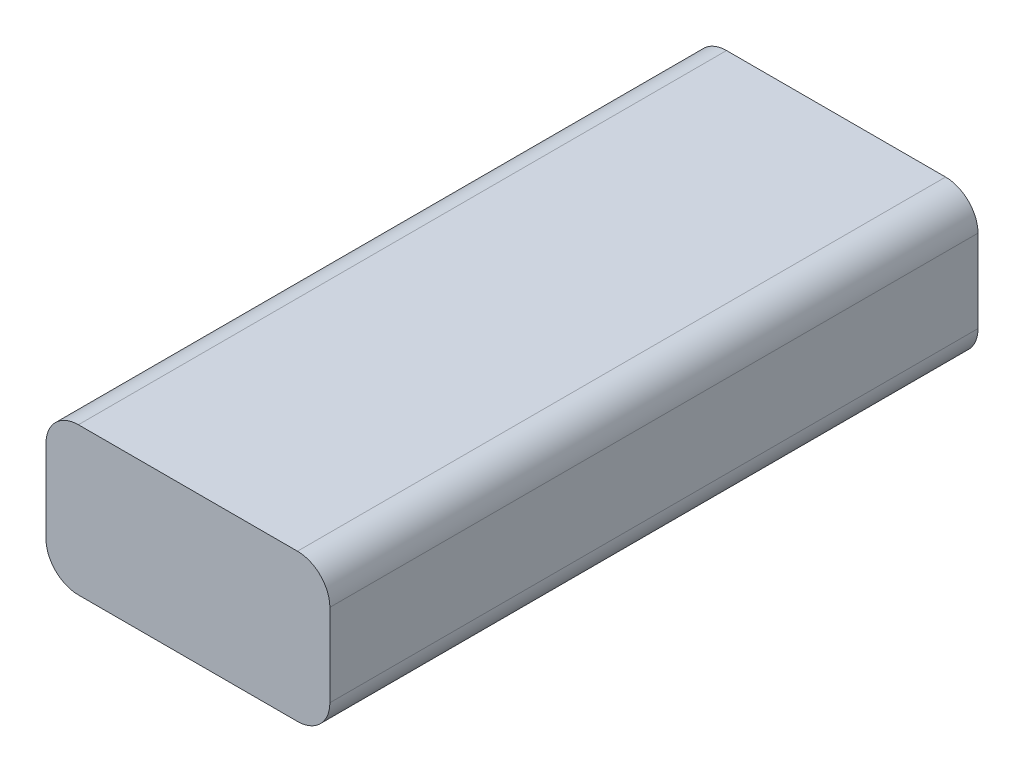
ISO-10303-21;
HEADER;
FILE_DESCRIPTION(('STEP AP214'),'2;1');
FILE_NAME('part.step','',(''),(''),'','','');
FILE_SCHEMA(('AUTOMOTIVE_DESIGN { 1 0 10303 214 1 1 1 1 }'));
ENDSEC;
DATA;
#1=APPLICATION_CONTEXT('core data for automotive mechanical design processes');
#2=APPLICATION_PROTOCOL_DEFINITION('international standard','automotive_design',2000,#1);
#3=PRODUCT_CONTEXT('',#1,'mechanical');
#4=PRODUCT('Part','Part','',(#3));
#5=PRODUCT_RELATED_PRODUCT_CATEGORY('part','',(#4));
#6=PRODUCT_DEFINITION_FORMATION('','',#4);
#7=PRODUCT_DEFINITION_CONTEXT('part definition',#1,'design');
#8=PRODUCT_DEFINITION('design','',#6,#7);
#9=PRODUCT_DEFINITION_SHAPE('','',#8);
#10=(LENGTH_UNIT() NAMED_UNIT(*) SI_UNIT(.MILLI.,.METRE.));
#11=(NAMED_UNIT(*) PLANE_ANGLE_UNIT() SI_UNIT($,.RADIAN.));
#12=(NAMED_UNIT(*) SI_UNIT($,.STERADIAN.) SOLID_ANGLE_UNIT());
#13=UNCERTAINTY_MEASURE_WITH_UNIT(LENGTH_MEASURE(1.E-05),#10,'distance_accuracy_value','');
#14=(GEOMETRIC_REPRESENTATION_CONTEXT(3) GLOBAL_UNCERTAINTY_ASSIGNED_CONTEXT((#13)) GLOBAL_UNIT_ASSIGNED_CONTEXT((#10,
#11,#12)) REPRESENTATION_CONTEXT('',''));
#15=CARTESIAN_POINT('',(0.,0.,0.));
#16=DIRECTION('',(0.,0.,1.));
#17=DIRECTION('',(1.,0.,0.));
#18=AXIS2_PLACEMENT_3D('',#15,#16,#17);
#19=CARTESIAN_POINT('',(-3.26703046092185,-0.305894388777558,25.4));
#20=DIRECTION('',(0.,0.,-1.));
#21=DIRECTION('',(-1.,0.,0.));
#22=AXIS2_PLACEMENT_3D('',#19,#20,#21);
#23=CYLINDRICAL_SURFACE('',#22,1.27);
#24=CARTESIAN_POINT('',(-3.26703046092185,-0.305894388777558,0.));
#25=DIRECTION('',(0.,0.,1.));
#26=DIRECTION('',(1.,0.,0.));
#27=AXIS2_PLACEMENT_3D('',#24,#25,#26);
#28=CIRCLE('',#27,1.27);
#29=CARTESIAN_POINT('',(-4.53703046092185,-0.305894388777549,0.));
#30=VERTEX_POINT('',#29);
#31=CARTESIAN_POINT('',(-3.26703046092184,-1.57589438877756,0.));
#32=VERTEX_POINT('',#31);
#33=EDGE_CURVE('E128',#30,#32,#28,.T.);
#34=ORIENTED_EDGE('',*,*,#33,.T.);
#35=DIRECTION('',(0.,0.,-1.));
#36=VECTOR('',#35,1.);
#37=CARTESIAN_POINT('',(-3.26703046092184,-1.57589438877756,25.4));
#38=LINE('',#37,#36);
#39=CARTESIAN_POINT('',(-3.26703046092184,-1.57589438877756,25.4));
#40=VERTEX_POINT('',#39);
#41=EDGE_CURVE('E11',#40,#32,#38,.T.);
#42=ORIENTED_EDGE('',*,*,#41,.F.);
#43=CARTESIAN_POINT('',(-3.26703046092185,-0.305894388777558,25.4));
#44=DIRECTION('',(0.,0.,1.));
#45=DIRECTION('',(1.,0.,0.));
#46=AXIS2_PLACEMENT_3D('',#43,#44,#45);
#47=CIRCLE('',#46,1.27);
#48=CARTESIAN_POINT('',(-4.53703046092185,-0.305894388777549,25.4));
#49=VERTEX_POINT('',#48);
#50=EDGE_CURVE('E142',#49,#40,#47,.T.);
#51=ORIENTED_EDGE('',*,*,#50,.F.);
#52=DIRECTION('',(0.,0.,-1.));
#53=VECTOR('',#52,1.);
#54=CARTESIAN_POINT('',(-4.53703046092185,-0.305894388777549,25.4));
#55=LINE('',#54,#53);
#56=EDGE_CURVE('E124',#49,#30,#55,.T.);
#57=ORIENTED_EDGE('',*,*,#56,.T.);
#58=EDGE_LOOP('',(#34,#42,#51,#57));
#59=FACE_BOUND('',#58,.T.);
#60=ADVANCED_FACE('F32',(#59),#23,.T.);
#61=CARTESIAN_POINT('',(5.31816953907815,-1.57589438877756,25.4));
#62=DIRECTION('',(0.,1.,0.));
#63=DIRECTION('',(-1.,0.,0.));
#64=AXIS2_PLACEMENT_3D('',#61,#62,#63);
#65=PLANE('',#64);
#66=DIRECTION('',(1.,0.,0.));
#67=VECTOR('',#66,1.);
#68=CARTESIAN_POINT('',(5.31816953907815,-1.57589438877756,0.));
#69=LINE('',#68,#67);
#70=CARTESIAN_POINT('',(5.31816953907814,-1.57589438877756,0.));
#71=VERTEX_POINT('',#70);
#72=EDGE_CURVE('E131',#32,#71,#69,.T.);
#73=ORIENTED_EDGE('',*,*,#72,.T.);
#74=DIRECTION('',(0.,0.,-1.));
#75=VECTOR('',#74,1.);
#76=CARTESIAN_POINT('',(5.31816953907814,-1.57589438877756,25.4));
#77=LINE('',#76,#75);
#78=CARTESIAN_POINT('',(5.31816953907814,-1.57589438877756,25.4));
#79=VERTEX_POINT('',#78);
#80=EDGE_CURVE('E40',#79,#71,#77,.T.);
#81=ORIENTED_EDGE('',*,*,#80,.F.);
#82=DIRECTION('',(1.,0.,0.));
#83=VECTOR('',#82,1.);
#84=CARTESIAN_POINT('',(5.31816953907815,-1.57589438877756,25.4));
#85=LINE('',#84,#83);
#86=EDGE_CURVE('E91',#40,#79,#85,.T.);
#87=ORIENTED_EDGE('',*,*,#86,.F.);
#88=ORIENTED_EDGE('',*,*,#41,.T.);
#89=EDGE_LOOP('',(#73,#81,#87,#88));
#90=FACE_BOUND('',#89,.T.);
#91=ADVANCED_FACE('F177',(#90),#65,.F.);
#92=CARTESIAN_POINT('',(5.31816953907815,-0.305894388777557,25.4));
#93=DIRECTION('',(0.,0.,-1.));
#94=DIRECTION('',(-1.,0.,0.));
#95=AXIS2_PLACEMENT_3D('',#92,#93,#94);
#96=CYLINDRICAL_SURFACE('',#95,1.27);
#97=CARTESIAN_POINT('',(5.31816953907815,-0.305894388777557,0.));
#98=DIRECTION('',(0.,0.,1.));
#99=DIRECTION('',(1.,0.,0.));
#100=AXIS2_PLACEMENT_3D('',#97,#98,#99);
#101=CIRCLE('',#100,1.27);
#102=CARTESIAN_POINT('',(6.58816953907816,-0.305894388777547,0.));
#103=VERTEX_POINT('',#102);
#104=EDGE_CURVE('E133',#71,#103,#101,.T.);
#105=ORIENTED_EDGE('',*,*,#104,.T.);
#106=DIRECTION('',(0.,0.,-1.));
#107=VECTOR('',#106,1.);
#108=CARTESIAN_POINT('',(6.58816953907816,-0.305894388777547,25.4));
#109=LINE('',#108,#107);
#110=CARTESIAN_POINT('',(6.58816953907816,-0.305894388777547,25.4));
#111=VERTEX_POINT('',#110);
#112=EDGE_CURVE('E149',#111,#103,#109,.T.);
#113=ORIENTED_EDGE('',*,*,#112,.F.);
#114=CARTESIAN_POINT('',(5.31816953907815,-0.305894388777557,25.4));
#115=DIRECTION('',(0.,0.,1.));
#116=DIRECTION('',(1.,0.,0.));
#117=AXIS2_PLACEMENT_3D('',#114,#115,#116);
#118=CIRCLE('',#117,1.27);
#119=EDGE_CURVE('E157',#79,#111,#118,.T.);
#120=ORIENTED_EDGE('',*,*,#119,.F.);
#121=ORIENTED_EDGE('',*,*,#80,.T.);
#122=EDGE_LOOP('',(#105,#113,#120,#121));
#123=FACE_BOUND('',#122,.T.);
#124=ADVANCED_FACE('F155',(#123),#96,.T.);
#125=CARTESIAN_POINT('',(6.58816953907815,2.93260561122243,25.4));
#126=DIRECTION('',(-1.,0.,0.));
#127=DIRECTION('',(0.,-1.,0.));
#128=AXIS2_PLACEMENT_3D('',#125,#126,#127);
#129=PLANE('',#128);
#130=DIRECTION('',(0.,1.,0.));
#131=VECTOR('',#130,1.);
#132=CARTESIAN_POINT('',(6.58816953907815,2.93260561122243,0.));
#133=LINE('',#132,#131);
#134=CARTESIAN_POINT('',(6.58816953907815,2.93260561122243,0.));
#135=VERTEX_POINT('',#134);
#136=EDGE_CURVE('E135',#103,#135,#133,.T.);
#137=ORIENTED_EDGE('',*,*,#136,.T.);
#138=DIRECTION('',(0.,0.,-1.));
#139=VECTOR('',#138,1.);
#140=CARTESIAN_POINT('',(6.58816953907815,2.93260561122243,25.4));
#141=LINE('',#140,#139);
#142=CARTESIAN_POINT('',(6.58816953907815,2.93260561122243,25.4));
#143=VERTEX_POINT('',#142);
#144=EDGE_CURVE('E146',#143,#135,#141,.T.);
#145=ORIENTED_EDGE('',*,*,#144,.F.);
#146=DIRECTION('',(0.,1.,0.));
#147=VECTOR('',#146,1.);
#148=CARTESIAN_POINT('',(6.58816953907815,2.93260561122243,25.4));
#149=LINE('',#148,#147);
#150=EDGE_CURVE('E169',#111,#143,#149,.T.);
#151=ORIENTED_EDGE('',*,*,#150,.F.);
#152=ORIENTED_EDGE('',*,*,#112,.T.);
#153=EDGE_LOOP('',(#137,#145,#151,#152));
#154=FACE_BOUND('',#153,.T.);
#155=ADVANCED_FACE('F165',(#154),#129,.F.);
#156=CARTESIAN_POINT('',(5.31816953907815,2.93260561122244,25.4));
#157=DIRECTION('',(0.,0.,-1.));
#158=DIRECTION('',(-1.,0.,0.));
#159=AXIS2_PLACEMENT_3D('',#156,#157,#158);
#160=CYLINDRICAL_SURFACE('',#159,1.27);
#161=CARTESIAN_POINT('',(5.31816953907815,2.93260561122244,0.));
#162=DIRECTION('',(0.,0.,1.));
#163=DIRECTION('',(1.,0.,0.));
#164=AXIS2_PLACEMENT_3D('',#161,#162,#163);
#165=CIRCLE('',#164,1.27);
#166=CARTESIAN_POINT('',(5.31816953907814,4.20260561122244,0.));
#167=VERTEX_POINT('',#166);
#168=EDGE_CURVE('E137',#135,#167,#165,.T.);
#169=ORIENTED_EDGE('',*,*,#168,.T.);
#170=DIRECTION('',(0.,0.,-1.));
#171=VECTOR('',#170,1.);
#172=CARTESIAN_POINT('',(5.31816953907814,4.20260561122244,25.4));
#173=LINE('',#172,#171);
#174=CARTESIAN_POINT('',(5.31816953907814,4.20260561122244,25.4));
#175=VERTEX_POINT('',#174);
#176=EDGE_CURVE('E119',#175,#167,#173,.T.);
#177=ORIENTED_EDGE('',*,*,#176,.F.);
#178=CARTESIAN_POINT('',(5.31816953907815,2.93260561122244,25.4));
#179=DIRECTION('',(0.,0.,1.));
#180=DIRECTION('',(1.,0.,0.));
#181=AXIS2_PLACEMENT_3D('',#178,#179,#180);
#182=CIRCLE('',#181,1.27);
#183=EDGE_CURVE('E110',#143,#175,#182,.T.);
#184=ORIENTED_EDGE('',*,*,#183,.F.);
#185=ORIENTED_EDGE('',*,*,#144,.T.);
#186=EDGE_LOOP('',(#169,#177,#184,#185));
#187=FACE_BOUND('',#186,.T.);
#188=ADVANCED_FACE('F168',(#187),#160,.T.);
#189=CARTESIAN_POINT('',(-3.26703046092184,4.20260561122244,25.4));
#190=DIRECTION('',(0.,-1.,0.));
#191=DIRECTION('',(0.,0.,-1.));
#192=AXIS2_PLACEMENT_3D('',#189,#190,#191);
#193=PLANE('',#192);
#194=DIRECTION('',(-1.,0.,0.));
#195=VECTOR('',#194,1.);
#196=CARTESIAN_POINT('',(-3.26703046092184,4.20260561122244,0.));
#197=LINE('',#196,#195);
#198=CARTESIAN_POINT('',(-3.26703046092184,4.20260561122244,0.));
#199=VERTEX_POINT('',#198);
#200=EDGE_CURVE('E118',#167,#199,#197,.T.);
#201=ORIENTED_EDGE('',*,*,#200,.T.);
#202=DIRECTION('',(0.,0.,-1.));
#203=VECTOR('',#202,1.);
#204=CARTESIAN_POINT('',(-3.26703046092184,4.20260561122244,25.4));
#205=LINE('',#204,#203);
#206=CARTESIAN_POINT('',(-3.26703046092184,4.20260561122244,25.4));
#207=VERTEX_POINT('',#206);
#208=EDGE_CURVE('E115',#207,#199,#205,.T.);
#209=ORIENTED_EDGE('',*,*,#208,.F.);
#210=DIRECTION('',(-1.,0.,0.));
#211=VECTOR('',#210,1.);
#212=CARTESIAN_POINT('',(-3.26703046092184,4.20260561122244,25.4));
#213=LINE('',#212,#211);
#214=EDGE_CURVE('E104',#175,#207,#213,.T.);
#215=ORIENTED_EDGE('',*,*,#214,.F.);
#216=ORIENTED_EDGE('',*,*,#176,.T.);
#217=EDGE_LOOP('',(#201,#209,#215,#216));
#218=FACE_BOUND('',#217,.T.);
#219=ADVANCED_FACE('F116',(#218),#193,.F.);
#220=CARTESIAN_POINT('',(-3.26703046092185,2.93260561122244,25.4));
#221=DIRECTION('',(0.,0.,-1.));
#222=DIRECTION('',(-1.,0.,0.));
#223=AXIS2_PLACEMENT_3D('',#220,#221,#222);
#224=CYLINDRICAL_SURFACE('',#223,1.27);
#225=CARTESIAN_POINT('',(-3.26703046092185,2.93260561122244,0.));
#226=DIRECTION('',(0.,0.,1.));
#227=DIRECTION('',(1.,0.,0.));
#228=AXIS2_PLACEMENT_3D('',#225,#226,#227);
#229=CIRCLE('',#228,1.27);
#230=CARTESIAN_POINT('',(-4.53703046092185,2.93260561122243,0.));
#231=VERTEX_POINT('',#230);
#232=EDGE_CURVE('E77',#199,#231,#229,.T.);
#233=ORIENTED_EDGE('',*,*,#232,.T.);
#234=DIRECTION('',(0.,0.,-1.));
#235=VECTOR('',#234,1.);
#236=CARTESIAN_POINT('',(-4.53703046092185,2.93260561122243,25.4));
#237=LINE('',#236,#235);
#238=CARTESIAN_POINT('',(-4.53703046092185,2.93260561122243,25.4));
#239=VERTEX_POINT('',#238);
#240=EDGE_CURVE('E120',#239,#231,#237,.T.);
#241=ORIENTED_EDGE('',*,*,#240,.F.);
#242=CARTESIAN_POINT('',(-3.26703046092185,2.93260561122244,25.4));
#243=DIRECTION('',(0.,0.,1.));
#244=DIRECTION('',(1.,0.,0.));
#245=AXIS2_PLACEMENT_3D('',#242,#243,#244);
#246=CIRCLE('',#245,1.27);
#247=EDGE_CURVE('E108',#207,#239,#246,.T.);
#248=ORIENTED_EDGE('',*,*,#247,.F.);
#249=ORIENTED_EDGE('',*,*,#208,.T.);
#250=EDGE_LOOP('',(#233,#241,#248,#249));
#251=FACE_BOUND('',#250,.T.);
#252=ADVANCED_FACE('F122',(#251),#224,.T.);
#253=CARTESIAN_POINT('',(-4.53703046092185,-0.305894388777549,25.4));
#254=DIRECTION('',(1.,0.,0.));
#255=DIRECTION('',(0.,0.,-1.));
#256=AXIS2_PLACEMENT_3D('',#253,#254,#255);
#257=PLANE('',#256);
#258=DIRECTION('',(0.,-1.,0.));
#259=VECTOR('',#258,1.);
#260=CARTESIAN_POINT('',(-4.53703046092185,-0.305894388777549,0.));
#261=LINE('',#260,#259);
#262=EDGE_CURVE('E83',#231,#30,#261,.T.);
#263=ORIENTED_EDGE('',*,*,#262,.T.);
#264=ORIENTED_EDGE('',*,*,#56,.F.);
#265=DIRECTION('',(0.,-1.,0.));
#266=VECTOR('',#265,1.);
#267=CARTESIAN_POINT('',(-4.53703046092185,-0.305894388777549,25.4));
#268=LINE('',#267,#266);
#269=EDGE_CURVE('E48',#239,#49,#268,.T.);
#270=ORIENTED_EDGE('',*,*,#269,.F.);
#271=ORIENTED_EDGE('',*,*,#240,.T.);
#272=EDGE_LOOP('',(#263,#264,#270,#271));
#273=FACE_BOUND('',#272,.T.);
#274=ADVANCED_FACE('F193',(#273),#257,.F.);
#275=CARTESIAN_POINT('',(-3.26703046092185,-0.305894388777558,25.4));
#276=DIRECTION('',(0.,0.,1.));
#277=DIRECTION('',(1.,0.,0.));
#278=AXIS2_PLACEMENT_3D('',#275,#276,#277);
#279=PLANE('',#278);
#280=ORIENTED_EDGE('',*,*,#50,.T.);
#281=ORIENTED_EDGE('',*,*,#86,.T.);
#282=ORIENTED_EDGE('',*,*,#119,.T.);
#283=ORIENTED_EDGE('',*,*,#150,.T.);
#284=ORIENTED_EDGE('',*,*,#183,.T.);
#285=ORIENTED_EDGE('',*,*,#214,.T.);
#286=ORIENTED_EDGE('',*,*,#247,.T.);
#287=ORIENTED_EDGE('',*,*,#269,.T.);
#288=EDGE_LOOP('',(#280,#281,#282,#283,#284,#285,#286,#287));
#289=FACE_BOUND('',#288,.T.);
#290=ADVANCED_FACE('F106',(#289),#279,.T.);
#291=CARTESIAN_POINT('',(-3.26703046092185,-0.305894388777558,0.));
#292=DIRECTION('',(0.,0.,1.));
#293=DIRECTION('',(1.,0.,0.));
#294=AXIS2_PLACEMENT_3D('',#291,#292,#293);
#295=PLANE('',#294);
#296=ORIENTED_EDGE('',*,*,#33,.F.);
#297=ORIENTED_EDGE('',*,*,#262,.F.);
#298=ORIENTED_EDGE('',*,*,#232,.F.);
#299=ORIENTED_EDGE('',*,*,#200,.F.);
#300=ORIENTED_EDGE('',*,*,#168,.F.);
#301=ORIENTED_EDGE('',*,*,#136,.F.);
#302=ORIENTED_EDGE('',*,*,#104,.F.);
#303=ORIENTED_EDGE('',*,*,#72,.F.);
#304=EDGE_LOOP('',(#296,#297,#298,#299,#300,#301,#302,#303));
#305=FACE_BOUND('',#304,.T.);
#306=ADVANCED_FACE('F161',(#305),#295,.F.);
#307=CLOSED_SHELL('',(#60,#91,#124,#155,#188,#219,#252,#274,#290,#306));
#308=MANIFOLD_SOLID_BREP('B2',#307);
#309=ADVANCED_BREP_SHAPE_REPRESENTATION('',(#18,#308),#14);
#310=SHAPE_DEFINITION_REPRESENTATION(#9,#309);
ENDSEC;
END-ISO-10303-21;
